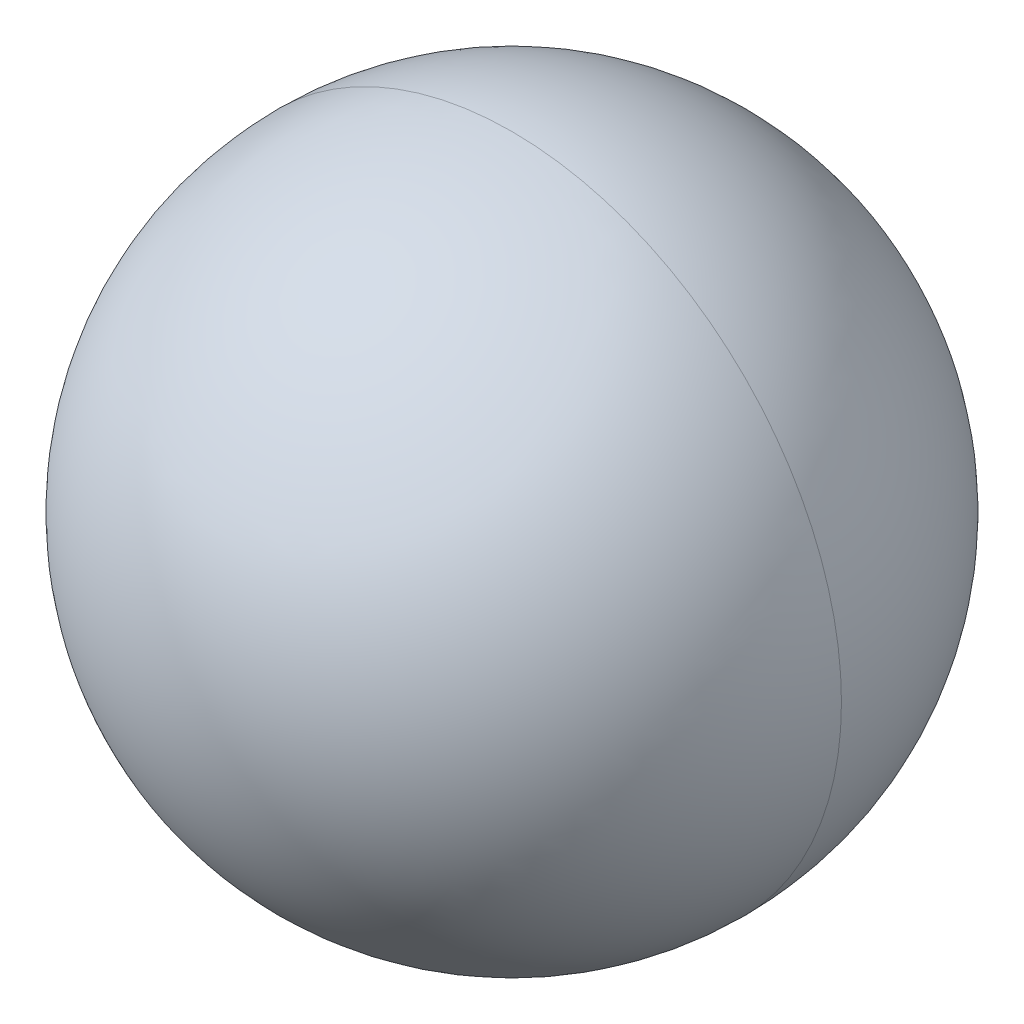
ISO-10303-21;
HEADER;
FILE_DESCRIPTION(('STEP AP214'),'2;1');
FILE_NAME('part.step','',(''),(''),'','','');
FILE_SCHEMA(('AUTOMOTIVE_DESIGN { 1 0 10303 214 1 1 1 1 }'));
ENDSEC;
DATA;
#1=APPLICATION_CONTEXT('core data for automotive mechanical design processes');
#2=APPLICATION_PROTOCOL_DEFINITION('international standard','automotive_design',2000,#1);
#3=PRODUCT_CONTEXT('',#1,'mechanical');
#4=PRODUCT('Part','Part','',(#3));
#5=PRODUCT_RELATED_PRODUCT_CATEGORY('part','',(#4));
#6=PRODUCT_DEFINITION_FORMATION('','',#4);
#7=PRODUCT_DEFINITION_CONTEXT('part definition',#1,'design');
#8=PRODUCT_DEFINITION('design','',#6,#7);
#9=PRODUCT_DEFINITION_SHAPE('','',#8);
#10=(LENGTH_UNIT() NAMED_UNIT(*) SI_UNIT(.MILLI.,.METRE.));
#11=(NAMED_UNIT(*) PLANE_ANGLE_UNIT() SI_UNIT($,.RADIAN.));
#12=(NAMED_UNIT(*) SI_UNIT($,.STERADIAN.) SOLID_ANGLE_UNIT());
#13=UNCERTAINTY_MEASURE_WITH_UNIT(LENGTH_MEASURE(1.E-05),#10,'distance_accuracy_value','');
#14=(GEOMETRIC_REPRESENTATION_CONTEXT(3) GLOBAL_UNCERTAINTY_ASSIGNED_CONTEXT((#13)) GLOBAL_UNIT_ASSIGNED_CONTEXT((#10,
#11,#12)) REPRESENTATION_CONTEXT('',''));
#15=CARTESIAN_POINT('',(0.,0.,0.));
#16=DIRECTION('',(0.,0.,1.));
#17=DIRECTION('',(1.,0.,0.));
#18=AXIS2_PLACEMENT_3D('',#15,#16,#17);
#19=CARTESIAN_POINT('',(0.,0.,0.));
#20=DIRECTION('',(0.,1.,0.));
#21=DIRECTION('',(1.,0.,0.));
#22=AXIS2_PLACEMENT_3D('',#19,#20,#21);
#23=SPHERICAL_SURFACE('',#22,0.2);
#24=CARTESIAN_POINT('',(0.,0.,0.));
#25=DIRECTION('',(0.,0.,-1.));
#26=DIRECTION('',(1.,0.,0.));
#27=AXIS2_PLACEMENT_3D('',#24,#25,#26);
#28=SPHERICAL_SURFACE('',#27,0.2);
#29=CARTESIAN_POINT('',(0.,0.,0.));
#30=DIRECTION('',(0.,0.,-1.));
#31=DIRECTION('',(1.,0.,0.));
#32=AXIS2_PLACEMENT_3D('',#29,#30,#31);
#33=CIRCLE('',#32,0.2);
#34=CARTESIAN_POINT('',(0.2,0.,0.));
#35=VERTEX_POINT('',#34);
#36=CARTESIAN_POINT('',(0.,-0.2,0.));
#37=VERTEX_POINT('',#36);
#38=EDGE_CURVE('E26',#35,#37,#33,.T.);
#39=ORIENTED_EDGE('',*,*,#38,.F.);
#40=CARTESIAN_POINT('',(0.,0.,0.));
#41=DIRECTION('',(0.,0.,1.));
#42=DIRECTION('',(1.,0.,0.));
#43=AXIS2_PLACEMENT_3D('',#40,#41,#42);
#44=CIRCLE('',#43,0.2);
#45=CARTESIAN_POINT('',(0.,0.2,0.));
#46=VERTEX_POINT('',#45);
#47=EDGE_CURVE('E49',#35,#46,#44,.T.);
#48=ORIENTED_EDGE('',*,*,#47,.T.);
#49=CARTESIAN_POINT('',(0.,0.,0.));
#50=DIRECTION('',(0.,0.,1.));
#51=DIRECTION('',(1.,0.,0.));
#52=AXIS2_PLACEMENT_3D('',#49,#50,#51);
#53=CIRCLE('',#52,0.2);
#54=CARTESIAN_POINT('',(-0.2,0.,0.));
#55=VERTEX_POINT('',#54);
#56=EDGE_CURVE('E50',#46,#55,#53,.T.);
#57=ORIENTED_EDGE('',*,*,#56,.T.);
#58=CARTESIAN_POINT('',(0.,0.,0.));
#59=DIRECTION('',(0.,0.,-1.));
#60=DIRECTION('',(1.,0.,0.));
#61=AXIS2_PLACEMENT_3D('',#58,#59,#60);
#62=CIRCLE('',#61,0.2);
#63=EDGE_CURVE('E11',#37,#55,#62,.T.);
#64=ORIENTED_EDGE('',*,*,#63,.F.);
#65=EDGE_LOOP('',(#39,#48,#57,#64));
#66=FACE_BOUND('',#65,.T.);
#67=ADVANCED_FACE('F17',(#66),#28,.T.);
#68=CARTESIAN_POINT('',(0.,0.,0.));
#69=DIRECTION('',(0.,1.,0.));
#70=DIRECTION('',(1.,0.,0.));
#71=AXIS2_PLACEMENT_3D('',#68,#69,#70);
#72=SPHERICAL_SURFACE('',#71,0.2);
#73=CARTESIAN_POINT('',(0.,0.,0.));
#74=DIRECTION('',(0.,0.,1.));
#75=DIRECTION('',(1.,0.,0.));
#76=AXIS2_PLACEMENT_3D('',#73,#74,#75);
#77=SPHERICAL_SURFACE('',#76,0.2);
#78=ORIENTED_EDGE('',*,*,#56,.F.);
#79=ORIENTED_EDGE('',*,*,#47,.F.);
#80=ORIENTED_EDGE('',*,*,#38,.T.);
#81=ORIENTED_EDGE('',*,*,#63,.T.);
#82=EDGE_LOOP('',(#78,#79,#80,#81));
#83=FACE_BOUND('',#82,.T.);
#84=ADVANCED_FACE('F53',(#83),#77,.T.);
#85=CLOSED_SHELL('',(#67,#84));
#86=MANIFOLD_SOLID_BREP('B1',#85);
#87=ADVANCED_BREP_SHAPE_REPRESENTATION('',(#18,#86),#14);
#88=SHAPE_DEFINITION_REPRESENTATION(#9,#87);
ENDSEC;
END-ISO-10303-21;
